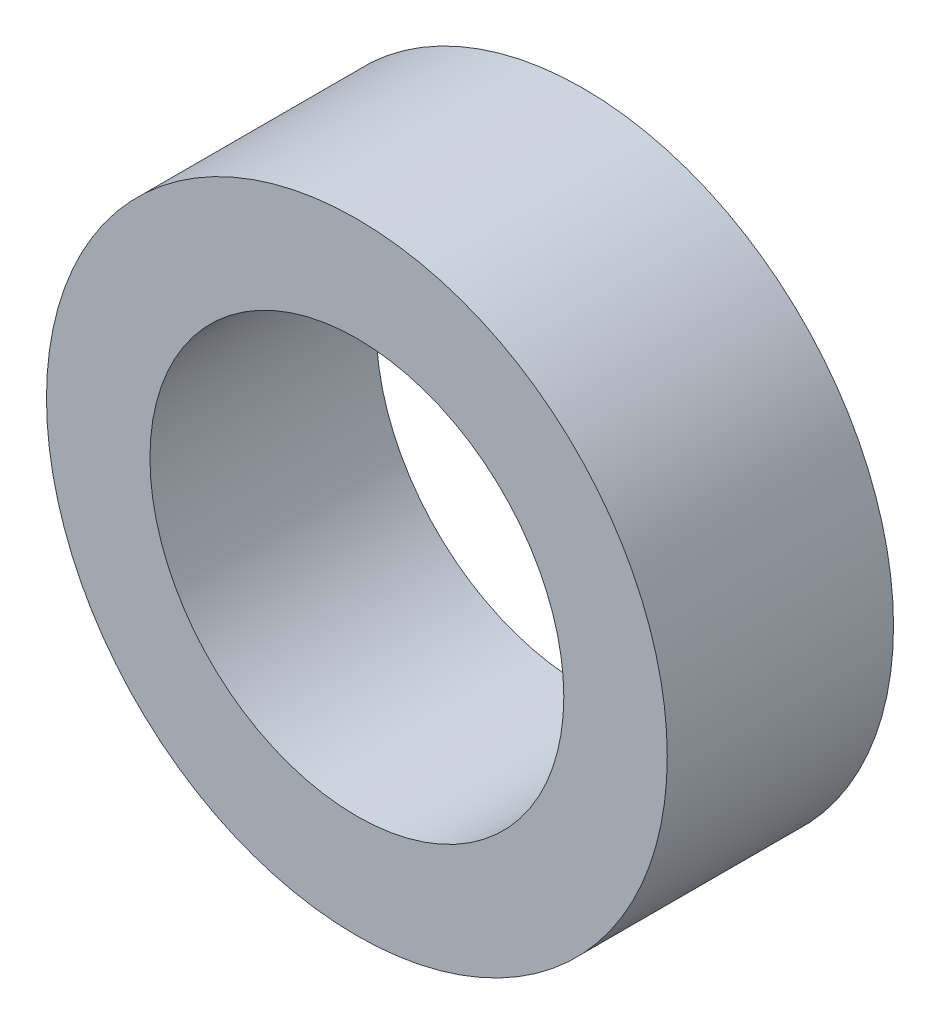
ISO-10303-21;
HEADER;
FILE_DESCRIPTION(('STEP AP214'),'2;1');
FILE_NAME('part.step','',(''),(''),'','','');
FILE_SCHEMA(('AUTOMOTIVE_DESIGN { 1 0 10303 214 1 1 1 1 }'));
ENDSEC;
DATA;
#1=APPLICATION_CONTEXT('core data for automotive mechanical design processes');
#2=APPLICATION_PROTOCOL_DEFINITION('international standard','automotive_design',2000,#1);
#3=PRODUCT_CONTEXT('',#1,'mechanical');
#4=PRODUCT('Part','Part','',(#3));
#5=PRODUCT_RELATED_PRODUCT_CATEGORY('part','',(#4));
#6=PRODUCT_DEFINITION_FORMATION('','',#4);
#7=PRODUCT_DEFINITION_CONTEXT('part definition',#1,'design');
#8=PRODUCT_DEFINITION('design','',#6,#7);
#9=PRODUCT_DEFINITION_SHAPE('','',#8);
#10=(LENGTH_UNIT() NAMED_UNIT(*) SI_UNIT(.MILLI.,.METRE.));
#11=(NAMED_UNIT(*) PLANE_ANGLE_UNIT() SI_UNIT($,.RADIAN.));
#12=(NAMED_UNIT(*) SI_UNIT($,.STERADIAN.) SOLID_ANGLE_UNIT());
#13=UNCERTAINTY_MEASURE_WITH_UNIT(LENGTH_MEASURE(1.E-05),#10,'distance_accuracy_value','');
#14=(GEOMETRIC_REPRESENTATION_CONTEXT(3) GLOBAL_UNCERTAINTY_ASSIGNED_CONTEXT((#13)) GLOBAL_UNIT_ASSIGNED_CONTEXT((#10,
#11,#12)) REPRESENTATION_CONTEXT('',''));
#15=CARTESIAN_POINT('',(0.,0.,0.));
#16=DIRECTION('',(0.,0.,1.));
#17=DIRECTION('',(1.,0.,0.));
#18=AXIS2_PLACEMENT_3D('',#15,#16,#17);
#19=CARTESIAN_POINT('',(-17.7,-16.75,1.64));
#20=DIRECTION('',(0.,0.,1.));
#21=DIRECTION('',(1.,0.,0.));
#22=AXIS2_PLACEMENT_3D('',#19,#20,#21);
#23=PLANE('',#22);
#24=CARTESIAN_POINT('',(-32.9,-2.5,1.64));
#25=DIRECTION('',(0.,0.,1.));
#26=DIRECTION('',(1.,0.,0.));
#27=AXIS2_PLACEMENT_3D('',#24,#25,#26);
#28=CIRCLE('',#27,1.5);
#29=CARTESIAN_POINT('',(-31.4,-2.5,1.64));
#30=VERTEX_POINT('',#29);
#31=EDGE_CURVE('E46',#30,#30,#28,.T.);
#32=ORIENTED_EDGE('',*,*,#31,.F.);
#33=EDGE_LOOP('',(#32));
#34=FACE_BOUND('',#33,.T.);
#35=CARTESIAN_POINT('',(-32.9,-2.5,1.64));
#36=DIRECTION('',(0.,0.,1.));
#37=DIRECTION('',(1.,0.,0.));
#38=AXIS2_PLACEMENT_3D('',#35,#36,#37);
#39=CIRCLE('',#38,2.25);
#40=CARTESIAN_POINT('',(-30.65,-2.5,1.64));
#41=VERTEX_POINT('',#40);
#42=EDGE_CURVE('E11',#41,#41,#39,.T.);
#43=ORIENTED_EDGE('',*,*,#42,.T.);
#44=EDGE_LOOP('',(#43));
#45=FACE_BOUND('',#44,.T.);
#46=ADVANCED_FACE('F16',(#34,#45),#23,.T.);
#47=CARTESIAN_POINT('',(-17.7,-16.75,0.));
#48=DIRECTION('',(0.,0.,1.));
#49=DIRECTION('',(1.,0.,0.));
#50=AXIS2_PLACEMENT_3D('',#47,#48,#49);
#51=PLANE('',#50);
#52=CARTESIAN_POINT('',(-32.9,-2.5,0.));
#53=DIRECTION('',(0.,0.,1.));
#54=DIRECTION('',(1.,0.,0.));
#55=AXIS2_PLACEMENT_3D('',#52,#53,#54);
#56=CIRCLE('',#55,1.5);
#57=CARTESIAN_POINT('',(-31.4,-2.5,0.));
#58=VERTEX_POINT('',#57);
#59=EDGE_CURVE('E20',#58,#58,#56,.T.);
#60=ORIENTED_EDGE('',*,*,#59,.T.);
#61=EDGE_LOOP('',(#60));
#62=FACE_BOUND('',#61,.T.);
#63=CARTESIAN_POINT('',(-32.9,-2.5,0.));
#64=DIRECTION('',(0.,0.,1.));
#65=DIRECTION('',(1.,0.,0.));
#66=AXIS2_PLACEMENT_3D('',#63,#64,#65);
#67=CIRCLE('',#66,2.25);
#68=CARTESIAN_POINT('',(-30.65,-2.5,0.));
#69=VERTEX_POINT('',#68);
#70=EDGE_CURVE('E27',#69,#69,#67,.T.);
#71=ORIENTED_EDGE('',*,*,#70,.F.);
#72=EDGE_LOOP('',(#71));
#73=FACE_BOUND('',#72,.T.);
#74=ADVANCED_FACE('F53',(#62,#73),#51,.F.);
#75=CARTESIAN_POINT('',(-32.9,-2.5,1.64));
#76=DIRECTION('',(0.,0.,1.));
#77=DIRECTION('',(-1.,0.,0.));
#78=AXIS2_PLACEMENT_3D('',#75,#76,#77);
#79=CYLINDRICAL_SURFACE('',#78,2.25);
#80=ORIENTED_EDGE('',*,*,#42,.F.);
#81=EDGE_LOOP('',(#80));
#82=FACE_BOUND('',#81,.T.);
#83=ORIENTED_EDGE('',*,*,#70,.T.);
#84=EDGE_LOOP('',(#83));
#85=FACE_BOUND('',#84,.T.);
#86=ADVANCED_FACE('F66',(#82,#85),#79,.T.);
#87=CARTESIAN_POINT('',(-32.9,-2.5,1.64));
#88=DIRECTION('',(0.,0.,1.));
#89=DIRECTION('',(-1.,0.,0.));
#90=AXIS2_PLACEMENT_3D('',#87,#88,#89);
#91=CYLINDRICAL_SURFACE('',#90,1.5);
#92=ORIENTED_EDGE('',*,*,#31,.T.);
#93=EDGE_LOOP('',(#92));
#94=FACE_BOUND('',#93,.T.);
#95=ORIENTED_EDGE('',*,*,#59,.F.);
#96=EDGE_LOOP('',(#95));
#97=FACE_BOUND('',#96,.T.);
#98=ADVANCED_FACE('F18',(#94,#97),#91,.F.);
#99=CLOSED_SHELL('',(#46,#74,#86,#98));
#100=MANIFOLD_SOLID_BREP('B1',#99);
#101=ADVANCED_BREP_SHAPE_REPRESENTATION('',(#18,#100),#14);
#102=SHAPE_DEFINITION_REPRESENTATION(#9,#101);
ENDSEC;
END-ISO-10303-21;
